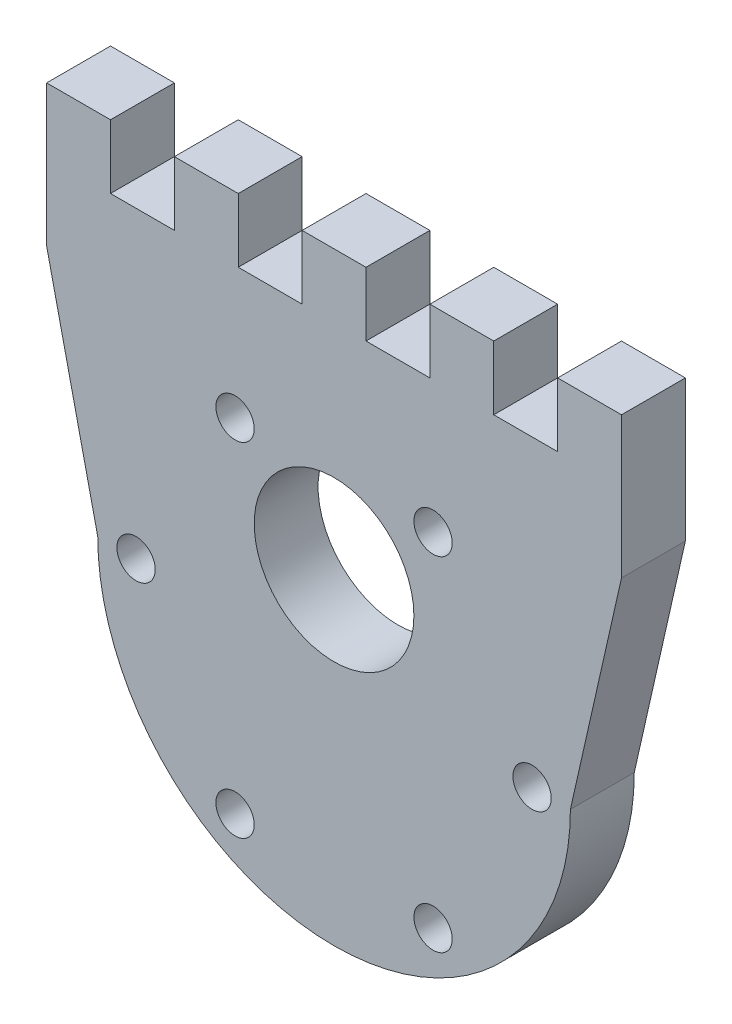
ISO-10303-21;
HEADER;
FILE_DESCRIPTION(('STEP AP214'),'2;1');
FILE_NAME('part.step','',(''),(''),'','','');
FILE_SCHEMA(('AUTOMOTIVE_DESIGN { 1 0 10303 214 1 1 1 1 }'));
ENDSEC;
DATA;
#1=APPLICATION_CONTEXT('core data for automotive mechanical design processes');
#2=APPLICATION_PROTOCOL_DEFINITION('international standard','automotive_design',2000,#1);
#3=PRODUCT_CONTEXT('',#1,'mechanical');
#4=PRODUCT('Part','Part','',(#3));
#5=PRODUCT_RELATED_PRODUCT_CATEGORY('part','',(#4));
#6=PRODUCT_DEFINITION_FORMATION('','',#4);
#7=PRODUCT_DEFINITION_CONTEXT('part definition',#1,'design');
#8=PRODUCT_DEFINITION('design','',#6,#7);
#9=PRODUCT_DEFINITION_SHAPE('','',#8);
#10=(LENGTH_UNIT() NAMED_UNIT(*) SI_UNIT(.MILLI.,.METRE.));
#11=(NAMED_UNIT(*) PLANE_ANGLE_UNIT() SI_UNIT($,.RADIAN.));
#12=(NAMED_UNIT(*) SI_UNIT($,.STERADIAN.) SOLID_ANGLE_UNIT());
#13=UNCERTAINTY_MEASURE_WITH_UNIT(LENGTH_MEASURE(1.E-05),#10,'distance_accuracy_value','');
#14=(GEOMETRIC_REPRESENTATION_CONTEXT(3) GLOBAL_UNCERTAINTY_ASSIGNED_CONTEXT((#13)) GLOBAL_UNIT_ASSIGNED_CONTEXT((#10,
#11,#12)) REPRESENTATION_CONTEXT('',''));
#15=CARTESIAN_POINT('',(0.,0.,0.));
#16=DIRECTION('',(0.,0.,1.));
#17=DIRECTION('',(1.,0.,0.));
#18=AXIS2_PLACEMENT_3D('',#15,#16,#17);
#19=CARTESIAN_POINT('',(0.,28.75,5.));
#20=DIRECTION('',(0.,1.,0.));
#21=DIRECTION('',(0.,0.,1.));
#22=AXIS2_PLACEMENT_3D('',#19,#20,#21);
#23=PLANE('',#22);
#24=DIRECTION('',(0.,0.,1.));
#25=VECTOR('',#24,1.);
#26=CARTESIAN_POINT('',(12.5,28.75,-5.));
#27=LINE('',#26,#25);
#28=CARTESIAN_POINT('',(12.5,28.75,0.));
#29=VERTEX_POINT('',#28);
#30=CARTESIAN_POINT('',(12.5,28.75,5.));
#31=VERTEX_POINT('',#30);
#32=EDGE_CURVE('E629',#29,#31,#27,.T.);
#33=ORIENTED_EDGE('',*,*,#32,.F.);
#34=DIRECTION('',(1.,0.,0.));
#35=VECTOR('',#34,1.);
#36=CARTESIAN_POINT('',(0.,28.75,0.));
#37=LINE('',#36,#35);
#38=CARTESIAN_POINT('',(7.5,28.75,0.));
#39=VERTEX_POINT('',#38);
#40=EDGE_CURVE('E624',#39,#29,#37,.T.);
#41=ORIENTED_EDGE('',*,*,#40,.F.);
#42=DIRECTION('',(0.,0.,1.));
#43=VECTOR('',#42,1.);
#44=CARTESIAN_POINT('',(7.5,28.75,-5.));
#45=LINE('',#44,#43);
#46=CARTESIAN_POINT('',(7.5,28.75,5.));
#47=VERTEX_POINT('',#46);
#48=EDGE_CURVE('E375',#39,#47,#45,.T.);
#49=ORIENTED_EDGE('',*,*,#48,.T.);
#50=DIRECTION('',(1.,0.,0.));
#51=VECTOR('',#50,1.);
#52=CARTESIAN_POINT('',(0.,28.75,5.));
#53=LINE('',#52,#51);
#54=EDGE_CURVE('E337',#47,#31,#53,.T.);
#55=ORIENTED_EDGE('',*,*,#54,.T.);
#56=EDGE_LOOP('',(#33,#41,#49,#55));
#57=FACE_BOUND('',#56,.T.);
#58=ADVANCED_FACE('F34',(#57),#23,.T.);
#59=DIRECTION('',(0.,0.,1.));
#60=VECTOR('',#59,1.);
#61=CARTESIAN_POINT('',(2.5,28.75,-5.));
#62=LINE('',#61,#60);
#63=CARTESIAN_POINT('',(2.5,28.75,0.));
#64=VERTEX_POINT('',#63);
#65=CARTESIAN_POINT('',(2.5,28.75,5.));
#66=VERTEX_POINT('',#65);
#67=EDGE_CURVE('E371',#64,#66,#62,.T.);
#68=ORIENTED_EDGE('',*,*,#67,.F.);
#69=CARTESIAN_POINT('',(-2.5,28.75,0.));
#70=VERTEX_POINT('',#69);
#71=EDGE_CURVE('E622',#70,#64,#37,.T.);
#72=ORIENTED_EDGE('',*,*,#71,.F.);
#73=DIRECTION('',(0.,0.,1.));
#74=VECTOR('',#73,1.);
#75=CARTESIAN_POINT('',(-2.5,28.75,-5.));
#76=LINE('',#75,#74);
#77=CARTESIAN_POINT('',(-2.5,28.75,5.));
#78=VERTEX_POINT('',#77);
#79=EDGE_CURVE('E385',#70,#78,#76,.T.);
#80=ORIENTED_EDGE('',*,*,#79,.T.);
#81=EDGE_CURVE('E342',#78,#66,#53,.T.);
#82=ORIENTED_EDGE('',*,*,#81,.T.);
#83=EDGE_LOOP('',(#68,#72,#80,#82));
#84=FACE_BOUND('',#83,.T.);
#85=ADVANCED_FACE('F412',(#84),#23,.T.);
#86=DIRECTION('',(0.,0.,1.));
#87=VECTOR('',#86,1.);
#88=CARTESIAN_POINT('',(-7.5,28.75,-5.));
#89=LINE('',#88,#87);
#90=CARTESIAN_POINT('',(-7.5,28.75,0.));
#91=VERTEX_POINT('',#90);
#92=CARTESIAN_POINT('',(-7.5,28.75,5.));
#93=VERTEX_POINT('',#92);
#94=EDGE_CURVE('E358',#91,#93,#89,.T.);
#95=ORIENTED_EDGE('',*,*,#94,.F.);
#96=CARTESIAN_POINT('',(-12.5,28.75,0.));
#97=VERTEX_POINT('',#96);
#98=EDGE_CURVE('E220',#97,#91,#37,.T.);
#99=ORIENTED_EDGE('',*,*,#98,.F.);
#100=DIRECTION('',(0.,0.,1.));
#101=VECTOR('',#100,1.);
#102=CARTESIAN_POINT('',(-12.5,28.75,-5.));
#103=LINE('',#102,#101);
#104=CARTESIAN_POINT('',(-12.5,28.75,5.));
#105=VERTEX_POINT('',#104);
#106=EDGE_CURVE('E284',#97,#105,#103,.T.);
#107=ORIENTED_EDGE('',*,*,#106,.T.);
#108=EDGE_CURVE('E205',#105,#93,#53,.T.);
#109=ORIENTED_EDGE('',*,*,#108,.T.);
#110=EDGE_LOOP('',(#95,#99,#107,#109));
#111=FACE_BOUND('',#110,.T.);
#112=ADVANCED_FACE('F356',(#111),#23,.T.);
#113=DIRECTION('',(0.,0.,-1.));
#114=VECTOR('',#113,1.);
#115=CARTESIAN_POINT('',(-22.5,28.75,5.));
#116=LINE('',#115,#114);
#117=CARTESIAN_POINT('',(-22.5,28.75,5.));
#118=VERTEX_POINT('',#117);
#119=CARTESIAN_POINT('',(-22.5,28.75,0.));
#120=VERTEX_POINT('',#119);
#121=EDGE_CURVE('E49',#118,#120,#116,.T.);
#122=ORIENTED_EDGE('',*,*,#121,.F.);
#123=CARTESIAN_POINT('',(-17.5,28.75,5.));
#124=VERTEX_POINT('',#123);
#125=EDGE_CURVE('E196',#118,#124,#53,.T.);
#126=ORIENTED_EDGE('',*,*,#125,.T.);
#127=DIRECTION('',(0.,0.,1.));
#128=VECTOR('',#127,1.);
#129=CARTESIAN_POINT('',(-17.5,28.75,-5.));
#130=LINE('',#129,#128);
#131=CARTESIAN_POINT('',(-17.5,28.75,0.));
#132=VERTEX_POINT('',#131);
#133=EDGE_CURVE('E280',#132,#124,#130,.T.);
#134=ORIENTED_EDGE('',*,*,#133,.F.);
#135=EDGE_CURVE('E217',#120,#132,#37,.T.);
#136=ORIENTED_EDGE('',*,*,#135,.F.);
#137=EDGE_LOOP('',(#122,#126,#134,#136));
#138=FACE_BOUND('',#137,.T.);
#139=ADVANCED_FACE('F278',(#138),#23,.T.);
#140=CARTESIAN_POINT('',(0.,0.,5.));
#141=DIRECTION('',(0.,0.,-1.));
#142=DIRECTION('',(-1.,0.,0.));
#143=AXIS2_PLACEMENT_3D('',#140,#141,#142);
#144=CYLINDRICAL_SURFACE('',#143,18.5);
#145=CARTESIAN_POINT('',(0.,0.,0.));
#146=DIRECTION('',(0.,0.,1.));
#147=DIRECTION('',(1.,0.,0.));
#148=AXIS2_PLACEMENT_3D('',#145,#146,#147);
#149=CIRCLE('',#148,18.5);
#150=CARTESIAN_POINT('',(18.5,0.,0.));
#151=VERTEX_POINT('',#150);
#152=CARTESIAN_POINT('',(-18.5,0.,0.));
#153=VERTEX_POINT('',#152);
#154=EDGE_CURVE('E210',#151,#153,#149,.F.);
#155=ORIENTED_EDGE('',*,*,#154,.F.);
#156=DIRECTION('',(0.,0.,-1.));
#157=VECTOR('',#156,1.);
#158=CARTESIAN_POINT('',(18.5,0.,5.));
#159=LINE('',#158,#157);
#160=CARTESIAN_POINT('',(18.5,0.,5.));
#161=VERTEX_POINT('',#160);
#162=EDGE_CURVE('E203',#161,#151,#159,.T.);
#163=ORIENTED_EDGE('',*,*,#162,.F.);
#164=CARTESIAN_POINT('',(0.,0.,5.));
#165=DIRECTION('',(0.,0.,1.));
#166=DIRECTION('',(1.,0.,0.));
#167=AXIS2_PLACEMENT_3D('',#164,#165,#166);
#168=CIRCLE('',#167,18.5);
#169=CARTESIAN_POINT('',(-18.5,0.,5.));
#170=VERTEX_POINT('',#169);
#171=EDGE_CURVE('E221',#161,#170,#168,.F.);
#172=ORIENTED_EDGE('',*,*,#171,.T.);
#173=DIRECTION('',(0.,0.,-1.));
#174=VECTOR('',#173,1.);
#175=CARTESIAN_POINT('',(-18.5,0.,5.));
#176=LINE('',#175,#174);
#177=EDGE_CURVE('E200',#170,#153,#176,.T.);
#178=ORIENTED_EDGE('',*,*,#177,.T.);
#179=EDGE_LOOP('',(#155,#163,#172,#178));
#180=FACE_BOUND('',#179,.T.);
#181=ADVANCED_FACE('F36',(#180),#144,.T.);
#182=CARTESIAN_POINT('',(17.6003524926264,-3.97921012876772,5.));
#183=DIRECTION('',(0.975382184072907,-0.22052118944257,0.));
#184=DIRECTION('',(0.22052118944257,0.975382184072907,0.));
#185=AXIS2_PLACEMENT_3D('',#182,#183,#184);
#186=PLANE('',#185);
#187=DIRECTION('',(0.,0.,-1.));
#188=VECTOR('',#187,1.);
#189=CARTESIAN_POINT('',(22.5,17.6923076923077,5.));
#190=LINE('',#189,#188);
#191=CARTESIAN_POINT('',(22.5,17.6923076923077,5.));
#192=VERTEX_POINT('',#191);
#193=CARTESIAN_POINT('',(22.5,17.6923076923077,0.));
#194=VERTEX_POINT('',#193);
#195=EDGE_CURVE('E56',#192,#194,#190,.T.);
#196=ORIENTED_EDGE('',*,*,#195,.F.);
#197=DIRECTION('',(-0.22052118944257,-0.975382184072907,0.));
#198=VECTOR('',#197,1.);
#199=CARTESIAN_POINT('',(17.6003524926264,-3.97921012876772,5.));
#200=LINE('',#199,#198);
#201=EDGE_CURVE('E272',#192,#161,#200,.T.);
#202=ORIENTED_EDGE('',*,*,#201,.T.);
#203=ORIENTED_EDGE('',*,*,#162,.T.);
#204=DIRECTION('',(-0.22052118944257,-0.975382184072907,0.));
#205=VECTOR('',#204,1.);
#206=CARTESIAN_POINT('',(17.6003524926264,-3.97921012876772,0.));
#207=LINE('',#206,#205);
#208=EDGE_CURVE('E213',#194,#151,#207,.T.);
#209=ORIENTED_EDGE('',*,*,#208,.F.);
#210=EDGE_LOOP('',(#196,#202,#203,#209));
#211=FACE_BOUND('',#210,.T.);
#212=ADVANCED_FACE('F268',(#211),#186,.T.);
#213=DIRECTION('',(0.,0.,1.));
#214=VECTOR('',#213,1.);
#215=CARTESIAN_POINT('',(22.5,28.75,5.));
#216=LINE('',#215,#214);
#217=CARTESIAN_POINT('',(22.5,28.75,0.));
#218=VERTEX_POINT('',#217);
#219=CARTESIAN_POINT('',(22.5,28.75,5.));
#220=VERTEX_POINT('',#219);
#221=EDGE_CURVE('E664',#218,#220,#216,.T.);
#222=ORIENTED_EDGE('',*,*,#221,.F.);
#223=CARTESIAN_POINT('',(17.5,28.75,0.));
#224=VERTEX_POINT('',#223);
#225=EDGE_CURVE('E216',#224,#218,#37,.T.);
#226=ORIENTED_EDGE('',*,*,#225,.F.);
#227=DIRECTION('',(0.,0.,1.));
#228=VECTOR('',#227,1.);
#229=CARTESIAN_POINT('',(17.5,28.75,-5.));
#230=LINE('',#229,#228);
#231=CARTESIAN_POINT('',(17.5,28.75,5.));
#232=VERTEX_POINT('',#231);
#233=EDGE_CURVE('E633',#224,#232,#230,.T.);
#234=ORIENTED_EDGE('',*,*,#233,.T.);
#235=EDGE_CURVE('E207',#232,#220,#53,.T.);
#236=ORIENTED_EDGE('',*,*,#235,.T.);
#237=EDGE_LOOP('',(#222,#226,#234,#236));
#238=FACE_BOUND('',#237,.T.);
#239=ADVANCED_FACE('F414',(#238),#23,.T.);
#240=CARTESIAN_POINT('',(-17.6003524926264,-3.97921012876772,5.));
#241=DIRECTION('',(0.975382184072907,0.22052118944257,0.));
#242=DIRECTION('',(-0.22052118944257,0.975382184072907,0.));
#243=AXIS2_PLACEMENT_3D('',#240,#241,#242);
#244=PLANE('',#243);
#245=DIRECTION('',(0.22052118944257,-0.975382184072907,0.));
#246=VECTOR('',#245,1.);
#247=CARTESIAN_POINT('',(-17.6003524926264,-3.97921012876772,5.));
#248=LINE('',#247,#246);
#249=CARTESIAN_POINT('',(-22.5,17.6923076923077,5.));
#250=VERTEX_POINT('',#249);
#251=EDGE_CURVE('E193',#250,#170,#248,.T.);
#252=ORIENTED_EDGE('',*,*,#251,.F.);
#253=DIRECTION('',(0.,0.,-1.));
#254=VECTOR('',#253,1.);
#255=CARTESIAN_POINT('',(-22.5,17.6923076923077,5.));
#256=LINE('',#255,#254);
#257=CARTESIAN_POINT('',(-22.5,17.6923076923077,0.));
#258=VERTEX_POINT('',#257);
#259=EDGE_CURVE('E180',#250,#258,#256,.T.);
#260=ORIENTED_EDGE('',*,*,#259,.T.);
#261=DIRECTION('',(0.22052118944257,-0.975382184072907,0.));
#262=VECTOR('',#261,1.);
#263=CARTESIAN_POINT('',(-17.6003524926264,-3.97921012876772,0.));
#264=LINE('',#263,#262);
#265=EDGE_CURVE('E219',#258,#153,#264,.T.);
#266=ORIENTED_EDGE('',*,*,#265,.T.);
#267=ORIENTED_EDGE('',*,*,#177,.F.);
#268=EDGE_LOOP('',(#252,#260,#266,#267));
#269=FACE_BOUND('',#268,.T.);
#270=ADVANCED_FACE('F198',(#269),#244,.F.);
#271=CARTESIAN_POINT('',(0.,0.,5.));
#272=DIRECTION('',(0.,0.,1.));
#273=DIRECTION('',(1.,0.,0.));
#274=AXIS2_PLACEMENT_3D('',#271,#272,#273);
#275=PLANE('',#274);
#276=DIRECTION('',(0.,1.,0.));
#277=VECTOR('',#276,1.);
#278=CARTESIAN_POINT('',(-22.5,39.9193722398898,5.));
#279=LINE('',#278,#277);
#280=EDGE_CURVE('E183',#250,#118,#279,.T.);
#281=ORIENTED_EDGE('',*,*,#280,.F.);
#282=ORIENTED_EDGE('',*,*,#251,.T.);
#283=ORIENTED_EDGE('',*,*,#171,.F.);
#284=ORIENTED_EDGE('',*,*,#201,.F.);
#285=DIRECTION('',(0.,-1.,0.));
#286=VECTOR('',#285,1.);
#287=CARTESIAN_POINT('',(22.5,39.9193722398898,5.));
#288=LINE('',#287,#286);
#289=EDGE_CURVE('E668',#220,#192,#288,.T.);
#290=ORIENTED_EDGE('',*,*,#289,.F.);
#291=ORIENTED_EDGE('',*,*,#235,.F.);
#292=DIRECTION('',(0.,1.,0.));
#293=VECTOR('',#292,1.);
#294=CARTESIAN_POINT('',(17.5,28.75,5.));
#295=LINE('',#294,#293);
#296=CARTESIAN_POINT('',(17.5,23.75,5.));
#297=VERTEX_POINT('',#296);
#298=EDGE_CURVE('E641',#297,#232,#295,.T.);
#299=ORIENTED_EDGE('',*,*,#298,.F.);
#300=DIRECTION('',(1.,0.,0.));
#301=VECTOR('',#300,1.);
#302=CARTESIAN_POINT('',(12.5,23.75,5.));
#303=LINE('',#302,#301);
#304=CARTESIAN_POINT('',(12.5,23.75,5.));
#305=VERTEX_POINT('',#304);
#306=EDGE_CURVE('E661',#305,#297,#303,.T.);
#307=ORIENTED_EDGE('',*,*,#306,.F.);
#308=DIRECTION('',(0.,-1.,0.));
#309=VECTOR('',#308,1.);
#310=CARTESIAN_POINT('',(12.5,28.75,5.));
#311=LINE('',#310,#309);
#312=EDGE_CURVE('E658',#31,#305,#311,.T.);
#313=ORIENTED_EDGE('',*,*,#312,.F.);
#314=ORIENTED_EDGE('',*,*,#54,.F.);
#315=DIRECTION('',(0.,1.,0.));
#316=VECTOR('',#315,1.);
#317=CARTESIAN_POINT('',(7.5,28.75,5.));
#318=LINE('',#317,#316);
#319=CARTESIAN_POINT('',(7.5,23.75,5.));
#320=VERTEX_POINT('',#319);
#321=EDGE_CURVE('E649',#320,#47,#318,.T.);
#322=ORIENTED_EDGE('',*,*,#321,.F.);
#323=DIRECTION('',(1.,0.,0.));
#324=VECTOR('',#323,1.);
#325=CARTESIAN_POINT('',(2.5,23.75,5.));
#326=LINE('',#325,#324);
#327=CARTESIAN_POINT('',(2.5,23.75,5.));
#328=VERTEX_POINT('',#327);
#329=EDGE_CURVE('E636',#328,#320,#326,.T.);
#330=ORIENTED_EDGE('',*,*,#329,.F.);
#331=DIRECTION('',(0.,-1.,0.));
#332=VECTOR('',#331,1.);
#333=CARTESIAN_POINT('',(2.5,28.75,5.));
#334=LINE('',#333,#332);
#335=EDGE_CURVE('E632',#66,#328,#334,.T.);
#336=ORIENTED_EDGE('',*,*,#335,.F.);
#337=ORIENTED_EDGE('',*,*,#81,.F.);
#338=DIRECTION('',(0.,1.,0.));
#339=VECTOR('',#338,1.);
#340=CARTESIAN_POINT('',(-2.5,28.75,5.));
#341=LINE('',#340,#339);
#342=CARTESIAN_POINT('',(-2.5,23.75,5.));
#343=VERTEX_POINT('',#342);
#344=EDGE_CURVE('E373',#343,#78,#341,.T.);
#345=ORIENTED_EDGE('',*,*,#344,.F.);
#346=DIRECTION('',(1.,0.,0.));
#347=VECTOR('',#346,1.);
#348=CARTESIAN_POINT('',(-7.5,23.75,5.));
#349=LINE('',#348,#347);
#350=CARTESIAN_POINT('',(-7.5,23.75,5.));
#351=VERTEX_POINT('',#350);
#352=EDGE_CURVE('E368',#351,#343,#349,.T.);
#353=ORIENTED_EDGE('',*,*,#352,.F.);
#354=DIRECTION('',(0.,-1.,0.));
#355=VECTOR('',#354,1.);
#356=CARTESIAN_POINT('',(-7.5,28.75,5.));
#357=LINE('',#356,#355);
#358=EDGE_CURVE('E365',#93,#351,#357,.T.);
#359=ORIENTED_EDGE('',*,*,#358,.F.);
#360=ORIENTED_EDGE('',*,*,#108,.F.);
#361=DIRECTION('',(0.,1.,0.));
#362=VECTOR('',#361,1.);
#363=CARTESIAN_POINT('',(-12.5,28.75,5.));
#364=LINE('',#363,#362);
#365=CARTESIAN_POINT('',(-12.5,23.75,5.));
#366=VERTEX_POINT('',#365);
#367=EDGE_CURVE('E293',#366,#105,#364,.T.);
#368=ORIENTED_EDGE('',*,*,#367,.F.);
#369=DIRECTION('',(1.,0.,0.));
#370=VECTOR('',#369,1.);
#371=CARTESIAN_POINT('',(-17.5,23.75,5.));
#372=LINE('',#371,#370);
#373=CARTESIAN_POINT('',(-17.5,23.75,5.));
#374=VERTEX_POINT('',#373);
#375=EDGE_CURVE('E390',#374,#366,#372,.T.);
#376=ORIENTED_EDGE('',*,*,#375,.F.);
#377=DIRECTION('',(0.,-1.,0.));
#378=VECTOR('',#377,1.);
#379=CARTESIAN_POINT('',(-17.5,28.75,5.));
#380=LINE('',#379,#378);
#381=EDGE_CURVE('E384',#124,#374,#380,.T.);
#382=ORIENTED_EDGE('',*,*,#381,.F.);
#383=ORIENTED_EDGE('',*,*,#125,.F.);
#384=EDGE_LOOP('',(#281,#282,#283,#284,#290,#291,#299,#307,#313,#314,#322,#330,#336,#337,#345,
#353,#359,#360,#368,#376,#382,#383));
#385=FACE_BOUND('',#384,.T.);
#386=CARTESIAN_POINT('',(0.,7.,5.));
#387=DIRECTION('',(0.,0.,1.));
#388=DIRECTION('',(1.,0.,0.));
#389=AXIS2_PLACEMENT_3D('',#386,#387,#388);
#390=CIRCLE('',#389,6.25);
#391=CARTESIAN_POINT('',(6.25,7.,5.));
#392=VERTEX_POINT('',#391);
#393=EDGE_CURVE('E283',#392,#392,#390,.T.);
#394=ORIENTED_EDGE('',*,*,#393,.F.);
#395=EDGE_LOOP('',(#394));
#396=FACE_BOUND('',#395,.T.);
#397=CARTESIAN_POINT('',(7.74999999999993,-13.4233937586588,5.));
#398=DIRECTION('',(0.,0.,1.));
#399=DIRECTION('',(0.50000000000001,0.866025403784433,0.));
#400=AXIS2_PLACEMENT_3D('',#397,#398,#399);
#401=CIRCLE('',#400,1.5);
#402=CARTESIAN_POINT('',(8.49999999999994,-12.1243556529822,5.));
#403=VERTEX_POINT('',#402);
#404=EDGE_CURVE('E300',#403,#403,#401,.T.);
#405=ORIENTED_EDGE('',*,*,#404,.F.);
#406=EDGE_LOOP('',(#405));
#407=FACE_BOUND('',#406,.T.);
#408=CARTESIAN_POINT('',(15.5,0.,5.));
#409=DIRECTION('',(0.,0.,1.));
#410=DIRECTION('',(-0.499999999999992,0.866025403784443,0.));
#411=AXIS2_PLACEMENT_3D('',#408,#409,#410);
#412=CIRCLE('',#411,1.5);
#413=CARTESIAN_POINT('',(14.75,1.29903810567662,5.));
#414=VERTEX_POINT('',#413);
#415=EDGE_CURVE('E305',#414,#414,#412,.T.);
#416=ORIENTED_EDGE('',*,*,#415,.F.);
#417=EDGE_LOOP('',(#416));
#418=FACE_BOUND('',#417,.T.);
#419=CARTESIAN_POINT('',(7.74999999999992,13.4233937586588,5.));
#420=DIRECTION('',(0.,0.,1.));
#421=DIRECTION('',(-1.,0.,0.));
#422=AXIS2_PLACEMENT_3D('',#419,#420,#421);
#423=CIRCLE('',#422,1.5);
#424=CARTESIAN_POINT('',(6.24999999999992,13.4233937586588,5.));
#425=VERTEX_POINT('',#424);
#426=EDGE_CURVE('E311',#425,#425,#423,.T.);
#427=ORIENTED_EDGE('',*,*,#426,.F.);
#428=EDGE_LOOP('',(#427));
#429=FACE_BOUND('',#428,.T.);
#430=CARTESIAN_POINT('',(-7.75000000000002,13.4233937586588,5.));
#431=DIRECTION('',(0.,0.,1.));
#432=DIRECTION('',(-0.500000000000004,-0.866025403784436,0.));
#433=AXIS2_PLACEMENT_3D('',#430,#431,#432);
#434=CIRCLE('',#433,1.5);
#435=CARTESIAN_POINT('',(-8.50000000000003,12.1243556529821,5.));
#436=VERTEX_POINT('',#435);
#437=EDGE_CURVE('E317',#436,#436,#434,.T.);
#438=ORIENTED_EDGE('',*,*,#437,.F.);
#439=EDGE_LOOP('',(#438));
#440=FACE_BOUND('',#439,.T.);
#441=CARTESIAN_POINT('',(-15.5,0.,5.));
#442=DIRECTION('',(0.,0.,1.));
#443=DIRECTION('',(0.499999999999998,-0.86602540378444,0.));
#444=AXIS2_PLACEMENT_3D('',#441,#442,#443);
#445=CIRCLE('',#444,1.5);
#446=CARTESIAN_POINT('',(-14.75,-1.29903810567672,5.));
#447=VERTEX_POINT('',#446);
#448=EDGE_CURVE('E323',#447,#447,#445,.T.);
#449=ORIENTED_EDGE('',*,*,#448,.F.);
#450=EDGE_LOOP('',(#449));
#451=FACE_BOUND('',#450,.T.);
#452=CARTESIAN_POINT('',(-7.74999999999992,-13.4233937586588,5.));
#453=DIRECTION('',(0.,0.,1.));
#454=DIRECTION('',(1.,0.,0.));
#455=AXIS2_PLACEMENT_3D('',#452,#453,#454);
#456=CIRCLE('',#455,1.5);
#457=CARTESIAN_POINT('',(-6.24999999999992,-13.4233937586588,5.));
#458=VERTEX_POINT('',#457);
#459=EDGE_CURVE('E329',#458,#458,#456,.T.);
#460=ORIENTED_EDGE('',*,*,#459,.F.);
#461=EDGE_LOOP('',(#460));
#462=FACE_BOUND('',#461,.T.);
#463=ADVANCED_FACE('F190',(#385,#396,#407,#418,#429,#440,#451,#462),#275,.T.);
#464=CARTESIAN_POINT('',(0.,0.,0.));
#465=DIRECTION('',(0.,0.,1.));
#466=DIRECTION('',(1.,0.,0.));
#467=AXIS2_PLACEMENT_3D('',#464,#465,#466);
#468=PLANE('',#467);
#469=ORIENTED_EDGE('',*,*,#265,.F.);
#470=DIRECTION('',(0.,1.,0.));
#471=VECTOR('',#470,1.);
#472=CARTESIAN_POINT('',(-22.5,0.,0.));
#473=LINE('',#472,#471);
#474=EDGE_CURVE('E11',#258,#120,#473,.T.);
#475=ORIENTED_EDGE('',*,*,#474,.T.);
#476=ORIENTED_EDGE('',*,*,#135,.T.);
#477=DIRECTION('',(0.,-1.,0.));
#478=VECTOR('',#477,1.);
#479=CARTESIAN_POINT('',(-17.5,0.,0.));
#480=LINE('',#479,#478);
#481=CARTESIAN_POINT('',(-17.5,23.75,0.));
#482=VERTEX_POINT('',#481);
#483=EDGE_CURVE('E231',#132,#482,#480,.T.);
#484=ORIENTED_EDGE('',*,*,#483,.T.);
#485=DIRECTION('',(1.,0.,0.));
#486=VECTOR('',#485,1.);
#487=CARTESIAN_POINT('',(0.,23.75,0.));
#488=LINE('',#487,#486);
#489=CARTESIAN_POINT('',(-12.5,23.75,0.));
#490=VERTEX_POINT('',#489);
#491=EDGE_CURVE('E225',#482,#490,#488,.T.);
#492=ORIENTED_EDGE('',*,*,#491,.T.);
#493=DIRECTION('',(0.,1.,0.));
#494=VECTOR('',#493,1.);
#495=CARTESIAN_POINT('',(-12.5,0.,0.));
#496=LINE('',#495,#494);
#497=EDGE_CURVE('E228',#490,#97,#496,.T.);
#498=ORIENTED_EDGE('',*,*,#497,.T.);
#499=ORIENTED_EDGE('',*,*,#98,.T.);
#500=DIRECTION('',(0.,-1.,0.));
#501=VECTOR('',#500,1.);
#502=CARTESIAN_POINT('',(-7.5,0.,0.));
#503=LINE('',#502,#501);
#504=CARTESIAN_POINT('',(-7.5,23.75,0.));
#505=VERTEX_POINT('',#504);
#506=EDGE_CURVE('E240',#91,#505,#503,.T.);
#507=ORIENTED_EDGE('',*,*,#506,.T.);
#508=DIRECTION('',(1.,0.,0.));
#509=VECTOR('',#508,1.);
#510=CARTESIAN_POINT('',(0.,23.75,0.));
#511=LINE('',#510,#509);
#512=CARTESIAN_POINT('',(-2.5,23.75,0.));
#513=VERTEX_POINT('',#512);
#514=EDGE_CURVE('E234',#505,#513,#511,.T.);
#515=ORIENTED_EDGE('',*,*,#514,.T.);
#516=DIRECTION('',(0.,1.,0.));
#517=VECTOR('',#516,1.);
#518=CARTESIAN_POINT('',(-2.5,0.,0.));
#519=LINE('',#518,#517);
#520=EDGE_CURVE('E237',#513,#70,#519,.T.);
#521=ORIENTED_EDGE('',*,*,#520,.T.);
#522=ORIENTED_EDGE('',*,*,#71,.T.);
#523=DIRECTION('',(0.,-1.,0.));
#524=VECTOR('',#523,1.);
#525=CARTESIAN_POINT('',(2.5,0.,0.));
#526=LINE('',#525,#524);
#527=CARTESIAN_POINT('',(2.5,23.75,0.));
#528=VERTEX_POINT('',#527);
#529=EDGE_CURVE('E249',#64,#528,#526,.T.);
#530=ORIENTED_EDGE('',*,*,#529,.T.);
#531=DIRECTION('',(1.,0.,0.));
#532=VECTOR('',#531,1.);
#533=CARTESIAN_POINT('',(0.,23.75,0.));
#534=LINE('',#533,#532);
#535=CARTESIAN_POINT('',(7.5,23.75,0.));
#536=VERTEX_POINT('',#535);
#537=EDGE_CURVE('E243',#528,#536,#534,.T.);
#538=ORIENTED_EDGE('',*,*,#537,.T.);
#539=DIRECTION('',(0.,1.,0.));
#540=VECTOR('',#539,1.);
#541=CARTESIAN_POINT('',(7.5,0.,0.));
#542=LINE('',#541,#540);
#543=EDGE_CURVE('E246',#536,#39,#542,.T.);
#544=ORIENTED_EDGE('',*,*,#543,.T.);
#545=ORIENTED_EDGE('',*,*,#40,.T.);
#546=DIRECTION('',(0.,-1.,0.));
#547=VECTOR('',#546,1.);
#548=CARTESIAN_POINT('',(12.5,0.,0.));
#549=LINE('',#548,#547);
#550=CARTESIAN_POINT('',(12.5,23.75,0.));
#551=VERTEX_POINT('',#550);
#552=EDGE_CURVE('E258',#29,#551,#549,.T.);
#553=ORIENTED_EDGE('',*,*,#552,.T.);
#554=DIRECTION('',(1.,0.,0.));
#555=VECTOR('',#554,1.);
#556=CARTESIAN_POINT('',(0.,23.75,0.));
#557=LINE('',#556,#555);
#558=CARTESIAN_POINT('',(17.5,23.75,0.));
#559=VERTEX_POINT('',#558);
#560=EDGE_CURVE('E252',#551,#559,#557,.T.);
#561=ORIENTED_EDGE('',*,*,#560,.T.);
#562=DIRECTION('',(0.,1.,0.));
#563=VECTOR('',#562,1.);
#564=CARTESIAN_POINT('',(17.5,0.,0.));
#565=LINE('',#564,#563);
#566=EDGE_CURVE('E255',#559,#224,#565,.T.);
#567=ORIENTED_EDGE('',*,*,#566,.T.);
#568=ORIENTED_EDGE('',*,*,#225,.T.);
#569=DIRECTION('',(0.,-1.,0.));
#570=VECTOR('',#569,1.);
#571=CARTESIAN_POINT('',(22.5,0.,0.));
#572=LINE('',#571,#570);
#573=EDGE_CURVE('E42',#218,#194,#572,.T.);
#574=ORIENTED_EDGE('',*,*,#573,.T.);
#575=ORIENTED_EDGE('',*,*,#208,.T.);
#576=ORIENTED_EDGE('',*,*,#154,.T.);
#577=EDGE_LOOP('',(#469,#475,#476,#484,#492,#498,#499,#507,#515,#521,#522,#530,#538,#544,#545,
#553,#561,#567,#568,#574,#575,#576));
#578=FACE_BOUND('',#577,.T.);
#579=CARTESIAN_POINT('',(0.,7.,0.));
#580=DIRECTION('',(0.,0.,1.));
#581=DIRECTION('',(1.,0.,0.));
#582=AXIS2_PLACEMENT_3D('',#579,#580,#581);
#583=CIRCLE('',#582,6.25);
#584=CARTESIAN_POINT('',(6.25,7.,0.));
#585=VERTEX_POINT('',#584);
#586=EDGE_CURVE('E287',#585,#585,#583,.T.);
#587=ORIENTED_EDGE('',*,*,#586,.T.);
#588=EDGE_LOOP('',(#587));
#589=FACE_BOUND('',#588,.T.);
#590=CARTESIAN_POINT('',(7.74999999999993,-13.4233937586588,0.));
#591=DIRECTION('',(0.,0.,1.));
#592=DIRECTION('',(0.50000000000001,0.866025403784433,0.));
#593=AXIS2_PLACEMENT_3D('',#590,#591,#592);
#594=CIRCLE('',#593,1.5);
#595=CARTESIAN_POINT('',(8.49999999999994,-12.1243556529822,0.));
#596=VERTEX_POINT('',#595);
#597=EDGE_CURVE('E302',#596,#596,#594,.T.);
#598=ORIENTED_EDGE('',*,*,#597,.T.);
#599=EDGE_LOOP('',(#598));
#600=FACE_BOUND('',#599,.T.);
#601=CARTESIAN_POINT('',(15.5,0.,0.));
#602=DIRECTION('',(0.,0.,1.));
#603=DIRECTION('',(-0.499999999999992,0.866025403784443,0.));
#604=AXIS2_PLACEMENT_3D('',#601,#602,#603);
#605=CIRCLE('',#604,1.5);
#606=CARTESIAN_POINT('',(14.75,1.29903810567662,0.));
#607=VERTEX_POINT('',#606);
#608=EDGE_CURVE('E308',#607,#607,#605,.T.);
#609=ORIENTED_EDGE('',*,*,#608,.T.);
#610=EDGE_LOOP('',(#609));
#611=FACE_BOUND('',#610,.T.);
#612=CARTESIAN_POINT('',(7.74999999999992,13.4233937586588,0.));
#613=DIRECTION('',(0.,0.,1.));
#614=DIRECTION('',(-1.,0.,0.));
#615=AXIS2_PLACEMENT_3D('',#612,#613,#614);
#616=CIRCLE('',#615,1.5);
#617=CARTESIAN_POINT('',(6.24999999999992,13.4233937586588,0.));
#618=VERTEX_POINT('',#617);
#619=EDGE_CURVE('E314',#618,#618,#616,.T.);
#620=ORIENTED_EDGE('',*,*,#619,.T.);
#621=EDGE_LOOP('',(#620));
#622=FACE_BOUND('',#621,.T.);
#623=CARTESIAN_POINT('',(-7.75000000000002,13.4233937586588,0.));
#624=DIRECTION('',(0.,0.,1.));
#625=DIRECTION('',(-0.500000000000004,-0.866025403784436,0.));
#626=AXIS2_PLACEMENT_3D('',#623,#624,#625);
#627=CIRCLE('',#626,1.5);
#628=CARTESIAN_POINT('',(-8.50000000000003,12.1243556529821,0.));
#629=VERTEX_POINT('',#628);
#630=EDGE_CURVE('E320',#629,#629,#627,.T.);
#631=ORIENTED_EDGE('',*,*,#630,.T.);
#632=EDGE_LOOP('',(#631));
#633=FACE_BOUND('',#632,.T.);
#634=CARTESIAN_POINT('',(-15.5,0.,0.));
#635=DIRECTION('',(0.,0.,1.));
#636=DIRECTION('',(0.499999999999998,-0.86602540378444,0.));
#637=AXIS2_PLACEMENT_3D('',#634,#635,#636);
#638=CIRCLE('',#637,1.5);
#639=CARTESIAN_POINT('',(-14.75,-1.29903810567672,0.));
#640=VERTEX_POINT('',#639);
#641=EDGE_CURVE('E326',#640,#640,#638,.T.);
#642=ORIENTED_EDGE('',*,*,#641,.T.);
#643=EDGE_LOOP('',(#642));
#644=FACE_BOUND('',#643,.T.);
#645=CARTESIAN_POINT('',(-7.74999999999992,-13.4233937586588,0.));
#646=DIRECTION('',(0.,0.,1.));
#647=DIRECTION('',(1.,0.,0.));
#648=AXIS2_PLACEMENT_3D('',#645,#646,#647);
#649=CIRCLE('',#648,1.5);
#650=CARTESIAN_POINT('',(-6.24999999999992,-13.4233937586588,0.));
#651=VERTEX_POINT('',#650);
#652=EDGE_CURVE('E214',#651,#651,#649,.T.);
#653=ORIENTED_EDGE('',*,*,#652,.T.);
#654=EDGE_LOOP('',(#653));
#655=FACE_BOUND('',#654,.T.);
#656=ADVANCED_FACE('F263',(#578,#589,#600,#611,#622,#633,#644,#655),#468,.F.);
#657=CARTESIAN_POINT('',(-7.74999999999992,-13.4233937586588,0.));
#658=DIRECTION('',(0.,0.,1.));
#659=DIRECTION('',(1.,0.,0.));
#660=AXIS2_PLACEMENT_3D('',#657,#658,#659);
#661=CYLINDRICAL_SURFACE('',#660,1.5);
#662=ORIENTED_EDGE('',*,*,#652,.F.);
#663=EDGE_LOOP('',(#662));
#664=FACE_BOUND('',#663,.T.);
#665=ORIENTED_EDGE('',*,*,#459,.T.);
#666=EDGE_LOOP('',(#665));
#667=FACE_BOUND('',#666,.T.);
#668=ADVANCED_FACE('F516',(#664,#667),#661,.F.);
#669=CARTESIAN_POINT('',(-15.5,0.,0.));
#670=DIRECTION('',(0.,0.,1.));
#671=DIRECTION('',(1.,0.,0.));
#672=AXIS2_PLACEMENT_3D('',#669,#670,#671);
#673=CYLINDRICAL_SURFACE('',#672,1.5);
#674=ORIENTED_EDGE('',*,*,#641,.F.);
#675=EDGE_LOOP('',(#674));
#676=FACE_BOUND('',#675,.T.);
#677=ORIENTED_EDGE('',*,*,#448,.T.);
#678=EDGE_LOOP('',(#677));
#679=FACE_BOUND('',#678,.T.);
#680=ADVANCED_FACE('F506',(#676,#679),#673,.F.);
#681=CARTESIAN_POINT('',(-7.75000000000002,13.4233937586588,0.));
#682=DIRECTION('',(0.,0.,1.));
#683=DIRECTION('',(1.,0.,0.));
#684=AXIS2_PLACEMENT_3D('',#681,#682,#683);
#685=CYLINDRICAL_SURFACE('',#684,1.5);
#686=ORIENTED_EDGE('',*,*,#630,.F.);
#687=EDGE_LOOP('',(#686));
#688=FACE_BOUND('',#687,.T.);
#689=ORIENTED_EDGE('',*,*,#437,.T.);
#690=EDGE_LOOP('',(#689));
#691=FACE_BOUND('',#690,.T.);
#692=ADVANCED_FACE('F496',(#688,#691),#685,.F.);
#693=CARTESIAN_POINT('',(7.74999999999992,13.4233937586588,0.));
#694=DIRECTION('',(0.,0.,1.));
#695=DIRECTION('',(1.,0.,0.));
#696=AXIS2_PLACEMENT_3D('',#693,#694,#695);
#697=CYLINDRICAL_SURFACE('',#696,1.5);
#698=ORIENTED_EDGE('',*,*,#619,.F.);
#699=EDGE_LOOP('',(#698));
#700=FACE_BOUND('',#699,.T.);
#701=ORIENTED_EDGE('',*,*,#426,.T.);
#702=EDGE_LOOP('',(#701));
#703=FACE_BOUND('',#702,.T.);
#704=ADVANCED_FACE('F486',(#700,#703),#697,.F.);
#705=CARTESIAN_POINT('',(15.5,0.,0.));
#706=DIRECTION('',(0.,0.,1.));
#707=DIRECTION('',(1.,0.,0.));
#708=AXIS2_PLACEMENT_3D('',#705,#706,#707);
#709=CYLINDRICAL_SURFACE('',#708,1.5);
#710=ORIENTED_EDGE('',*,*,#608,.F.);
#711=EDGE_LOOP('',(#710));
#712=FACE_BOUND('',#711,.T.);
#713=ORIENTED_EDGE('',*,*,#415,.T.);
#714=EDGE_LOOP('',(#713));
#715=FACE_BOUND('',#714,.T.);
#716=ADVANCED_FACE('F476',(#712,#715),#709,.F.);
#717=CARTESIAN_POINT('',(7.74999999999993,-13.4233937586588,0.));
#718=DIRECTION('',(0.,0.,1.));
#719=DIRECTION('',(1.,0.,0.));
#720=AXIS2_PLACEMENT_3D('',#717,#718,#719);
#721=CYLINDRICAL_SURFACE('',#720,1.5);
#722=ORIENTED_EDGE('',*,*,#597,.F.);
#723=EDGE_LOOP('',(#722));
#724=FACE_BOUND('',#723,.T.);
#725=ORIENTED_EDGE('',*,*,#404,.T.);
#726=EDGE_LOOP('',(#725));
#727=FACE_BOUND('',#726,.T.);
#728=ADVANCED_FACE('F407',(#724,#727),#721,.F.);
#729=CARTESIAN_POINT('',(0.,7.,0.));
#730=DIRECTION('',(0.,0.,1.));
#731=DIRECTION('',(1.,0.,0.));
#732=AXIS2_PLACEMENT_3D('',#729,#730,#731);
#733=CYLINDRICAL_SURFACE('',#732,6.25);
#734=ORIENTED_EDGE('',*,*,#586,.F.);
#735=EDGE_LOOP('',(#734));
#736=FACE_BOUND('',#735,.T.);
#737=ORIENTED_EDGE('',*,*,#393,.T.);
#738=EDGE_LOOP('',(#737));
#739=FACE_BOUND('',#738,.T.);
#740=ADVANCED_FACE('F400',(#736,#739),#733,.F.);
#741=CARTESIAN_POINT('',(-17.5,28.75,-5.));
#742=DIRECTION('',(-1.,0.,0.));
#743=DIRECTION('',(0.,0.,1.));
#744=AXIS2_PLACEMENT_3D('',#741,#742,#743);
#745=PLANE('',#744);
#746=ORIENTED_EDGE('',*,*,#133,.T.);
#747=ORIENTED_EDGE('',*,*,#381,.T.);
#748=DIRECTION('',(0.,0.,1.));
#749=VECTOR('',#748,1.);
#750=CARTESIAN_POINT('',(-17.5,23.75,-5.));
#751=LINE('',#750,#749);
#752=EDGE_CURVE('E297',#482,#374,#751,.T.);
#753=ORIENTED_EDGE('',*,*,#752,.F.);
#754=ORIENTED_EDGE('',*,*,#483,.F.);
#755=EDGE_LOOP('',(#746,#747,#753,#754));
#756=FACE_BOUND('',#755,.T.);
#757=ADVANCED_FACE('F398',(#756),#745,.F.);
#758=CARTESIAN_POINT('',(-12.5,28.75,-5.));
#759=DIRECTION('',(1.,0.,0.));
#760=DIRECTION('',(0.,0.,-1.));
#761=AXIS2_PLACEMENT_3D('',#758,#759,#760);
#762=PLANE('',#761);
#763=DIRECTION('',(0.,0.,1.));
#764=VECTOR('',#763,1.);
#765=CARTESIAN_POINT('',(-12.5,23.75,-5.));
#766=LINE('',#765,#764);
#767=EDGE_CURVE('E290',#490,#366,#766,.T.);
#768=ORIENTED_EDGE('',*,*,#767,.T.);
#769=ORIENTED_EDGE('',*,*,#367,.T.);
#770=ORIENTED_EDGE('',*,*,#106,.F.);
#771=ORIENTED_EDGE('',*,*,#497,.F.);
#772=EDGE_LOOP('',(#768,#769,#770,#771));
#773=FACE_BOUND('',#772,.T.);
#774=ADVANCED_FACE('F394',(#773),#762,.F.);
#775=CARTESIAN_POINT('',(-17.5,23.75,-5.));
#776=DIRECTION('',(0.,-1.,0.));
#777=DIRECTION('',(0.,0.,-1.));
#778=AXIS2_PLACEMENT_3D('',#775,#776,#777);
#779=PLANE('',#778);
#780=ORIENTED_EDGE('',*,*,#752,.T.);
#781=ORIENTED_EDGE('',*,*,#375,.T.);
#782=ORIENTED_EDGE('',*,*,#767,.F.);
#783=ORIENTED_EDGE('',*,*,#491,.F.);
#784=EDGE_LOOP('',(#780,#781,#782,#783));
#785=FACE_BOUND('',#784,.T.);
#786=ADVANCED_FACE('F396',(#785),#779,.F.);
#787=CARTESIAN_POINT('',(-7.5,28.75,-5.));
#788=DIRECTION('',(-1.,0.,0.));
#789=DIRECTION('',(0.,0.,1.));
#790=AXIS2_PLACEMENT_3D('',#787,#788,#789);
#791=PLANE('',#790);
#792=ORIENTED_EDGE('',*,*,#94,.T.);
#793=ORIENTED_EDGE('',*,*,#358,.T.);
#794=DIRECTION('',(0.,0.,1.));
#795=VECTOR('',#794,1.);
#796=CARTESIAN_POINT('',(-7.5,23.75,-5.));
#797=LINE('',#796,#795);
#798=EDGE_CURVE('E382',#505,#351,#797,.T.);
#799=ORIENTED_EDGE('',*,*,#798,.F.);
#800=ORIENTED_EDGE('',*,*,#506,.F.);
#801=EDGE_LOOP('',(#792,#793,#799,#800));
#802=FACE_BOUND('',#801,.T.);
#803=ADVANCED_FACE('F450',(#802),#791,.F.);
#804=CARTESIAN_POINT('',(-2.5,28.75,-5.));
#805=DIRECTION('',(1.,0.,0.));
#806=DIRECTION('',(0.,0.,-1.));
#807=AXIS2_PLACEMENT_3D('',#804,#805,#806);
#808=PLANE('',#807);
#809=DIRECTION('',(0.,0.,1.));
#810=VECTOR('',#809,1.);
#811=CARTESIAN_POINT('',(-2.5,23.75,-5.));
#812=LINE('',#811,#810);
#813=EDGE_CURVE('E387',#513,#343,#812,.T.);
#814=ORIENTED_EDGE('',*,*,#813,.T.);
#815=ORIENTED_EDGE('',*,*,#344,.T.);
#816=ORIENTED_EDGE('',*,*,#79,.F.);
#817=ORIENTED_EDGE('',*,*,#520,.F.);
#818=EDGE_LOOP('',(#814,#815,#816,#817));
#819=FACE_BOUND('',#818,.T.);
#820=ADVANCED_FACE('F614',(#819),#808,.F.);
#821=CARTESIAN_POINT('',(-7.5,23.75,-5.));
#822=DIRECTION('',(0.,-1.,0.));
#823=DIRECTION('',(0.,0.,-1.));
#824=AXIS2_PLACEMENT_3D('',#821,#822,#823);
#825=PLANE('',#824);
#826=ORIENTED_EDGE('',*,*,#798,.T.);
#827=ORIENTED_EDGE('',*,*,#352,.T.);
#828=ORIENTED_EDGE('',*,*,#813,.F.);
#829=ORIENTED_EDGE('',*,*,#514,.F.);
#830=EDGE_LOOP('',(#826,#827,#828,#829));
#831=FACE_BOUND('',#830,.T.);
#832=ADVANCED_FACE('F612',(#831),#825,.F.);
#833=CARTESIAN_POINT('',(2.5,28.75,-5.));
#834=DIRECTION('',(-1.,0.,0.));
#835=DIRECTION('',(0.,0.,1.));
#836=AXIS2_PLACEMENT_3D('',#833,#834,#835);
#837=PLANE('',#836);
#838=ORIENTED_EDGE('',*,*,#67,.T.);
#839=ORIENTED_EDGE('',*,*,#335,.T.);
#840=DIRECTION('',(0.,0.,1.));
#841=VECTOR('',#840,1.);
#842=CARTESIAN_POINT('',(2.5,23.75,-5.));
#843=LINE('',#842,#841);
#844=EDGE_CURVE('E378',#528,#328,#843,.T.);
#845=ORIENTED_EDGE('',*,*,#844,.F.);
#846=ORIENTED_EDGE('',*,*,#529,.F.);
#847=EDGE_LOOP('',(#838,#839,#845,#846));
#848=FACE_BOUND('',#847,.T.);
#849=ADVANCED_FACE('F605',(#848),#837,.F.);
#850=CARTESIAN_POINT('',(7.5,28.75,-5.));
#851=DIRECTION('',(1.,0.,0.));
#852=DIRECTION('',(0.,0.,-1.));
#853=AXIS2_PLACEMENT_3D('',#850,#851,#852);
#854=PLANE('',#853);
#855=DIRECTION('',(0.,0.,1.));
#856=VECTOR('',#855,1.);
#857=CARTESIAN_POINT('',(7.5,23.75,-5.));
#858=LINE('',#857,#856);
#859=EDGE_CURVE('E651',#536,#320,#858,.T.);
#860=ORIENTED_EDGE('',*,*,#859,.T.);
#861=ORIENTED_EDGE('',*,*,#321,.T.);
#862=ORIENTED_EDGE('',*,*,#48,.F.);
#863=ORIENTED_EDGE('',*,*,#543,.F.);
#864=EDGE_LOOP('',(#860,#861,#862,#863));
#865=FACE_BOUND('',#864,.T.);
#866=ADVANCED_FACE('F602',(#865),#854,.F.);
#867=CARTESIAN_POINT('',(2.5,23.75,-5.));
#868=DIRECTION('',(0.,-1.,0.));
#869=DIRECTION('',(0.,0.,-1.));
#870=AXIS2_PLACEMENT_3D('',#867,#868,#869);
#871=PLANE('',#870);
#872=ORIENTED_EDGE('',*,*,#844,.T.);
#873=ORIENTED_EDGE('',*,*,#329,.T.);
#874=ORIENTED_EDGE('',*,*,#859,.F.);
#875=ORIENTED_EDGE('',*,*,#537,.F.);
#876=EDGE_LOOP('',(#872,#873,#874,#875));
#877=FACE_BOUND('',#876,.T.);
#878=ADVANCED_FACE('F600',(#877),#871,.F.);
#879=CARTESIAN_POINT('',(12.5,28.75,-5.));
#880=DIRECTION('',(-1.,0.,0.));
#881=DIRECTION('',(0.,0.,1.));
#882=AXIS2_PLACEMENT_3D('',#879,#880,#881);
#883=PLANE('',#882);
#884=ORIENTED_EDGE('',*,*,#32,.T.);
#885=ORIENTED_EDGE('',*,*,#312,.T.);
#886=DIRECTION('',(0.,0.,1.));
#887=VECTOR('',#886,1.);
#888=CARTESIAN_POINT('',(12.5,23.75,-5.));
#889=LINE('',#888,#887);
#890=EDGE_CURVE('E645',#551,#305,#889,.T.);
#891=ORIENTED_EDGE('',*,*,#890,.F.);
#892=ORIENTED_EDGE('',*,*,#552,.F.);
#893=EDGE_LOOP('',(#884,#885,#891,#892));
#894=FACE_BOUND('',#893,.T.);
#895=ADVANCED_FACE('F594',(#894),#883,.F.);
#896=CARTESIAN_POINT('',(17.5,28.75,-5.));
#897=DIRECTION('',(1.,0.,0.));
#898=DIRECTION('',(0.,0.,-1.));
#899=AXIS2_PLACEMENT_3D('',#896,#897,#898);
#900=PLANE('',#899);
#901=DIRECTION('',(0.,0.,1.));
#902=VECTOR('',#901,1.);
#903=CARTESIAN_POINT('',(17.5,23.75,-5.));
#904=LINE('',#903,#902);
#905=EDGE_CURVE('E638',#559,#297,#904,.T.);
#906=ORIENTED_EDGE('',*,*,#905,.T.);
#907=ORIENTED_EDGE('',*,*,#298,.T.);
#908=ORIENTED_EDGE('',*,*,#233,.F.);
#909=ORIENTED_EDGE('',*,*,#566,.F.);
#910=EDGE_LOOP('',(#906,#907,#908,#909));
#911=FACE_BOUND('',#910,.T.);
#912=ADVANCED_FACE('F591',(#911),#900,.F.);
#913=CARTESIAN_POINT('',(12.5,23.75,-5.));
#914=DIRECTION('',(0.,-1.,0.));
#915=DIRECTION('',(0.,0.,-1.));
#916=AXIS2_PLACEMENT_3D('',#913,#914,#915);
#917=PLANE('',#916);
#918=ORIENTED_EDGE('',*,*,#890,.T.);
#919=ORIENTED_EDGE('',*,*,#306,.T.);
#920=ORIENTED_EDGE('',*,*,#905,.F.);
#921=ORIENTED_EDGE('',*,*,#560,.F.);
#922=EDGE_LOOP('',(#918,#919,#920,#921));
#923=FACE_BOUND('',#922,.T.);
#924=ADVANCED_FACE('F576',(#923),#917,.F.);
#925=CARTESIAN_POINT('',(22.5,39.9193722398898,-5.));
#926=DIRECTION('',(-1.,0.,0.));
#927=DIRECTION('',(0.,-1.,0.));
#928=AXIS2_PLACEMENT_3D('',#925,#926,#927);
#929=PLANE('',#928);
#930=ORIENTED_EDGE('',*,*,#195,.T.);
#931=ORIENTED_EDGE('',*,*,#573,.F.);
#932=ORIENTED_EDGE('',*,*,#221,.T.);
#933=ORIENTED_EDGE('',*,*,#289,.T.);
#934=EDGE_LOOP('',(#930,#931,#932,#933));
#935=FACE_BOUND('',#934,.T.);
#936=ADVANCED_FACE('F571',(#935),#929,.F.);
#937=CARTESIAN_POINT('',(-22.5,39.9193722398898,-5.));
#938=DIRECTION('',(1.,0.,0.));
#939=DIRECTION('',(0.,1.,0.));
#940=AXIS2_PLACEMENT_3D('',#937,#938,#939);
#941=PLANE('',#940);
#942=ORIENTED_EDGE('',*,*,#121,.T.);
#943=ORIENTED_EDGE('',*,*,#474,.F.);
#944=ORIENTED_EDGE('',*,*,#259,.F.);
#945=ORIENTED_EDGE('',*,*,#280,.T.);
#946=EDGE_LOOP('',(#942,#943,#944,#945));
#947=FACE_BOUND('',#946,.T.);
#948=ADVANCED_FACE('F182',(#947),#941,.F.);
#949=CLOSED_SHELL('',(#58,#85,#112,#139,#181,#212,#239,#270,#463,#656,#668,#680,#692,#704,#716,
#728,#740,#757,#774,#786,#803,#820,#832,#849,#866,#878,#895,#912,#924,#936,#948));
#950=MANIFOLD_SOLID_BREP('B2',#949);
#951=ADVANCED_BREP_SHAPE_REPRESENTATION('',(#18,#950),#14);
#952=SHAPE_DEFINITION_REPRESENTATION(#9,#951);
ENDSEC;
END-ISO-10303-21;
